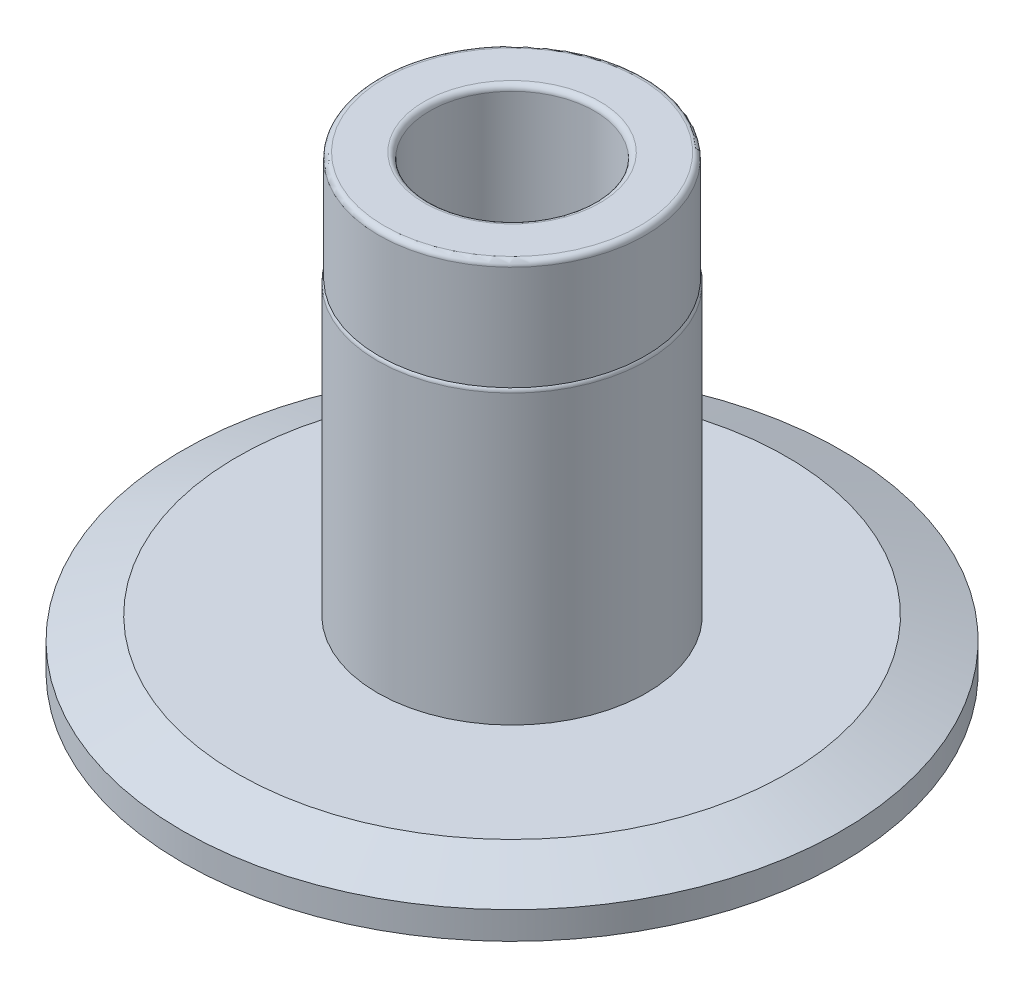
ISO-10303-21;
HEADER;
FILE_DESCRIPTION(('STEP AP214'),'2;1');
FILE_NAME('part.step','',(''),(''),'','','');
FILE_SCHEMA(('AUTOMOTIVE_DESIGN { 1 0 10303 214 1 1 1 1 }'));
ENDSEC;
DATA;
#1=APPLICATION_CONTEXT('core data for automotive mechanical design processes');
#2=APPLICATION_PROTOCOL_DEFINITION('international standard','automotive_design',2000,#1);
#3=PRODUCT_CONTEXT('',#1,'mechanical');
#4=PRODUCT('Part','Part','',(#3));
#5=PRODUCT_RELATED_PRODUCT_CATEGORY('part','',(#4));
#6=PRODUCT_DEFINITION_FORMATION('','',#4);
#7=PRODUCT_DEFINITION_CONTEXT('part definition',#1,'design');
#8=PRODUCT_DEFINITION('design','',#6,#7);
#9=PRODUCT_DEFINITION_SHAPE('','',#8);
#10=(LENGTH_UNIT() NAMED_UNIT(*) SI_UNIT(.MILLI.,.METRE.));
#11=(NAMED_UNIT(*) PLANE_ANGLE_UNIT() SI_UNIT($,.RADIAN.));
#12=(NAMED_UNIT(*) SI_UNIT($,.STERADIAN.) SOLID_ANGLE_UNIT());
#13=UNCERTAINTY_MEASURE_WITH_UNIT(LENGTH_MEASURE(1.E-05),#10,'distance_accuracy_value','');
#14=(GEOMETRIC_REPRESENTATION_CONTEXT(3) GLOBAL_UNCERTAINTY_ASSIGNED_CONTEXT((#13)) GLOBAL_UNIT_ASSIGNED_CONTEXT((#10,
#11,#12)) REPRESENTATION_CONTEXT('',''));
#15=CARTESIAN_POINT('',(0.,0.,0.));
#16=DIRECTION('',(0.,0.,1.));
#17=DIRECTION('',(1.,0.,0.));
#18=AXIS2_PLACEMENT_3D('',#15,#16,#17);
#19=CARTESIAN_POINT('',(0.,-0.4,0.));
#20=DIRECTION('',(0.,1.,0.));
#21=DIRECTION('',(0.,0.,1.));
#22=AXIS2_PLACEMENT_3D('',#19,#20,#21);
#23=CYLINDRICAL_SURFACE('',#22,2.45);
#24=CARTESIAN_POINT('',(0.,6.13385621722338,0.));
#25=DIRECTION('',(0.,1.,0.));
#26=DIRECTION('',(0.,0.,1.));
#27=AXIS2_PLACEMENT_3D('',#24,#25,#26);
#28=CIRCLE('',#27,2.45);
#29=CARTESIAN_POINT('',(0.,6.13385621722338,2.45));
#30=VERTEX_POINT('',#29);
#31=EDGE_CURVE('E54',#30,#30,#28,.F.);
#32=ORIENTED_EDGE('',*,*,#31,.T.);
#33=EDGE_LOOP('',(#32));
#34=FACE_BOUND('',#33,.T.);
#35=CARTESIAN_POINT('',(0.,0.9,0.));
#36=DIRECTION('',(0.,1.,0.));
#37=DIRECTION('',(0.,0.,1.));
#38=AXIS2_PLACEMENT_3D('',#35,#36,#37);
#39=CIRCLE('',#38,2.45);
#40=CARTESIAN_POINT('',(0.,0.9,2.45));
#41=VERTEX_POINT('',#40);
#42=EDGE_CURVE('E91',#41,#41,#39,.T.);
#43=ORIENTED_EDGE('',*,*,#42,.T.);
#44=EDGE_LOOP('',(#43));
#45=FACE_BOUND('',#44,.T.);
#46=ADVANCED_FACE('F39',(#34,#45),#23,.T.);
#47=CARTESIAN_POINT('',(0.,8.2,0.));
#48=DIRECTION('',(0.,1.,0.));
#49=DIRECTION('',(0.,0.,1.));
#50=AXIS2_PLACEMENT_3D('',#47,#48,#49);
#51=PLANE('',#50);
#52=CARTESIAN_POINT('',(0.,8.2,0.));
#53=DIRECTION('',(0.,1.,0.));
#54=DIRECTION('',(0.,0.,1.));
#55=AXIS2_PLACEMENT_3D('',#52,#53,#54);
#56=CIRCLE('',#55,2.325);
#57=CARTESIAN_POINT('',(0.,8.2,2.325));
#58=VERTEX_POINT('',#57);
#59=EDGE_CURVE('E83',#58,#58,#56,.T.);
#60=ORIENTED_EDGE('',*,*,#59,.T.);
#61=EDGE_LOOP('',(#60));
#62=FACE_BOUND('',#61,.T.);
#63=CARTESIAN_POINT('',(0.,8.2,0.));
#64=DIRECTION('',(0.,1.,0.));
#65=DIRECTION('',(0.,0.,1.));
#66=AXIS2_PLACEMENT_3D('',#63,#64,#65);
#67=CIRCLE('',#66,1.6);
#68=CARTESIAN_POINT('',(0.,8.2,1.6));
#69=VERTEX_POINT('',#68);
#70=EDGE_CURVE('E87',#69,#69,#67,.F.);
#71=ORIENTED_EDGE('',*,*,#70,.T.);
#72=EDGE_LOOP('',(#71));
#73=FACE_BOUND('',#72,.T.);
#74=ADVANCED_FACE('F118',(#62,#73),#51,.T.);
#75=CARTESIAN_POINT('',(0.,0.9,0.));
#76=DIRECTION('',(0.,1.,0.));
#77=DIRECTION('',(0.,0.,1.));
#78=AXIS2_PLACEMENT_3D('',#75,#76,#77);
#79=PLANE('',#78);
#80=CARTESIAN_POINT('',(0.,0.9,0.));
#81=DIRECTION('',(0.,1.,0.));
#82=DIRECTION('',(0.,0.,1.));
#83=AXIS2_PLACEMENT_3D('',#80,#81,#82);
#84=CIRCLE('',#83,4.99999999999999);
#85=CARTESIAN_POINT('',(0.,0.9,4.99999999999999));
#86=VERTEX_POINT('',#85);
#87=EDGE_CURVE('E47',#86,#86,#84,.T.);
#88=ORIENTED_EDGE('',*,*,#87,.T.);
#89=EDGE_LOOP('',(#88));
#90=FACE_BOUND('',#89,.T.);
#91=ORIENTED_EDGE('',*,*,#42,.F.);
#92=EDGE_LOOP('',(#91));
#93=FACE_BOUND('',#92,.T.);
#94=ADVANCED_FACE('F123',(#90,#93),#79,.T.);
#95=CARTESIAN_POINT('',(0.,0.,0.));
#96=DIRECTION('',(0.,1.,0.));
#97=DIRECTION('',(0.,0.,1.));
#98=AXIS2_PLACEMENT_3D('',#95,#96,#97);
#99=PLANE('',#98);
#100=CARTESIAN_POINT('',(0.,0.,0.));
#101=DIRECTION('',(0.,1.,0.));
#102=DIRECTION('',(0.,0.,1.));
#103=AXIS2_PLACEMENT_3D('',#100,#101,#102);
#104=CIRCLE('',#103,2.45);
#105=CARTESIAN_POINT('',(0.,0.,2.45));
#106=VERTEX_POINT('',#105);
#107=EDGE_CURVE('E92',#106,#106,#104,.T.);
#108=ORIENTED_EDGE('',*,*,#107,.T.);
#109=EDGE_LOOP('',(#108));
#110=FACE_BOUND('',#109,.T.);
#111=CARTESIAN_POINT('',(0.,0.,0.));
#112=DIRECTION('',(0.,1.,0.));
#113=DIRECTION('',(0.,0.,1.));
#114=AXIS2_PLACEMENT_3D('',#111,#112,#113);
#115=CIRCLE('',#114,6.);
#116=CARTESIAN_POINT('',(0.,0.,6.));
#117=VERTEX_POINT('',#116);
#118=EDGE_CURVE('E96',#117,#117,#115,.T.);
#119=ORIENTED_EDGE('',*,*,#118,.F.);
#120=EDGE_LOOP('',(#119));
#121=FACE_BOUND('',#120,.T.);
#122=ADVANCED_FACE('F125',(#110,#121),#99,.F.);
#123=CARTESIAN_POINT('',(0.,0.9,0.));
#124=DIRECTION('',(0.,-1.,0.));
#125=DIRECTION('',(0.,0.,-1.));
#126=AXIS2_PLACEMENT_3D('',#123,#124,#125);
#127=CYLINDRICAL_SURFACE('',#126,6.);
#128=CARTESIAN_POINT('',(0.,0.499999999999999,0.));
#129=DIRECTION('',(0.,1.,0.));
#130=DIRECTION('',(0.,0.,1.));
#131=AXIS2_PLACEMENT_3D('',#128,#129,#130);
#132=CIRCLE('',#131,6.);
#133=CARTESIAN_POINT('',(0.,0.499999999999999,6.));
#134=VERTEX_POINT('',#133);
#135=EDGE_CURVE('E11',#134,#134,#132,.F.);
#136=ORIENTED_EDGE('',*,*,#135,.T.);
#137=EDGE_LOOP('',(#136));
#138=FACE_BOUND('',#137,.T.);
#139=ORIENTED_EDGE('',*,*,#118,.T.);
#140=EDGE_LOOP('',(#139));
#141=FACE_BOUND('',#140,.T.);
#142=ADVANCED_FACE('F131',(#138,#141),#127,.T.);
#143=CARTESIAN_POINT('',(0.,-0.3,0.));
#144=DIRECTION('',(0.,1.,0.));
#145=DIRECTION('',(0.,0.,1.));
#146=AXIS2_PLACEMENT_3D('',#143,#144,#145);
#147=CIRCLE('',#146,2.45);
#148=CARTESIAN_POINT('',(0.,-0.3,2.45));
#149=VERTEX_POINT('',#148);
#150=EDGE_CURVE('E61',#149,#149,#147,.T.);
#151=ORIENTED_EDGE('',*,*,#150,.T.);
#152=EDGE_LOOP('',(#151));
#153=FACE_BOUND('',#152,.T.);
#154=ORIENTED_EDGE('',*,*,#107,.F.);
#155=EDGE_LOOP('',(#154));
#156=FACE_BOUND('',#155,.T.);
#157=ADVANCED_FACE('F120',(#153,#156),#23,.T.);
#158=CARTESIAN_POINT('',(0.,-0.4,0.));
#159=DIRECTION('',(0.,1.,0.));
#160=DIRECTION('',(0.,0.,1.));
#161=AXIS2_PLACEMENT_3D('',#158,#159,#160);
#162=PLANE('',#161);
#163=CARTESIAN_POINT('',(0.,-0.4,0.));
#164=DIRECTION('',(0.,1.,0.));
#165=DIRECTION('',(0.,0.,1.));
#166=AXIS2_PLACEMENT_3D('',#163,#164,#165);
#167=CIRCLE('',#166,1.6);
#168=CARTESIAN_POINT('',(0.,-0.4,1.6));
#169=VERTEX_POINT('',#168);
#170=EDGE_CURVE('E67',#169,#169,#167,.T.);
#171=ORIENTED_EDGE('',*,*,#170,.T.);
#172=EDGE_LOOP('',(#171));
#173=FACE_BOUND('',#172,.T.);
#174=CARTESIAN_POINT('',(0.,-0.4,0.));
#175=DIRECTION('',(0.,1.,0.));
#176=DIRECTION('',(0.,0.,1.));
#177=AXIS2_PLACEMENT_3D('',#174,#175,#176);
#178=CIRCLE('',#177,2.35);
#179=CARTESIAN_POINT('',(0.,-0.4,2.35));
#180=VERTEX_POINT('',#179);
#181=EDGE_CURVE('E71',#180,#180,#178,.F.);
#182=ORIENTED_EDGE('',*,*,#181,.T.);
#183=EDGE_LOOP('',(#182));
#184=FACE_BOUND('',#183,.T.);
#185=ADVANCED_FACE('F163',(#173,#184),#162,.F.);
#186=CARTESIAN_POINT('',(0.,0.9,0.));
#187=DIRECTION('',(0.,-1.,0.));
#188=DIRECTION('',(0.,0.,-1.));
#189=AXIS2_PLACEMENT_3D('',#186,#187,#188);
#190=CYLINDRICAL_SURFACE('',#189,1.5);
#191=CARTESIAN_POINT('',(0.,8.1,0.));
#192=DIRECTION('',(0.,1.,0.));
#193=DIRECTION('',(0.,0.,1.));
#194=AXIS2_PLACEMENT_3D('',#191,#192,#193);
#195=CIRCLE('',#194,1.5);
#196=CARTESIAN_POINT('',(0.,8.1,1.5));
#197=VERTEX_POINT('',#196);
#198=EDGE_CURVE('E74',#197,#197,#195,.T.);
#199=ORIENTED_EDGE('',*,*,#198,.T.);
#200=EDGE_LOOP('',(#199));
#201=FACE_BOUND('',#200,.T.);
#202=CARTESIAN_POINT('',(0.,-0.3,0.));
#203=DIRECTION('',(0.,1.,0.));
#204=DIRECTION('',(0.,0.,1.));
#205=AXIS2_PLACEMENT_3D('',#202,#203,#204);
#206=CIRCLE('',#205,1.5);
#207=CARTESIAN_POINT('',(0.,-0.3,1.5));
#208=VERTEX_POINT('',#207);
#209=EDGE_CURVE('E77',#208,#208,#206,.F.);
#210=ORIENTED_EDGE('',*,*,#209,.T.);
#211=EDGE_LOOP('',(#210));
#212=FACE_BOUND('',#211,.T.);
#213=ADVANCED_FACE('F137',(#201,#212),#190,.F.);
#214=CARTESIAN_POINT('',(0.,6.2,0.));
#215=DIRECTION('',(0.,1.,0.));
#216=DIRECTION('',(0.,0.,1.));
#217=AXIS2_PLACEMENT_3D('',#214,#215,#216);
#218=CYLINDRICAL_SURFACE('',#217,2.425);
#219=CARTESIAN_POINT('',(0.,8.1,0.));
#220=DIRECTION('',(0.,1.,0.));
#221=DIRECTION('',(0.,0.,1.));
#222=AXIS2_PLACEMENT_3D('',#219,#220,#221);
#223=CIRCLE('',#222,2.425);
#224=CARTESIAN_POINT('',(0.,8.1,2.425));
#225=VERTEX_POINT('',#224);
#226=EDGE_CURVE('E80',#225,#225,#223,.F.);
#227=ORIENTED_EDGE('',*,*,#226,.T.);
#228=EDGE_LOOP('',(#227));
#229=FACE_BOUND('',#228,.T.);
#230=CARTESIAN_POINT('',(0.,6.2,0.));
#231=DIRECTION('',(0.,1.,0.));
#232=DIRECTION('',(0.,0.,1.));
#233=AXIS2_PLACEMENT_3D('',#230,#231,#232);
#234=CIRCLE('',#233,2.425);
#235=CARTESIAN_POINT('',(0.,6.2,2.425));
#236=VERTEX_POINT('',#235);
#237=EDGE_CURVE('E97',#236,#236,#234,.T.);
#238=ORIENTED_EDGE('',*,*,#237,.T.);
#239=EDGE_LOOP('',(#238));
#240=FACE_BOUND('',#239,.T.);
#241=ADVANCED_FACE('F108',(#229,#240),#218,.T.);
#242=CARTESIAN_POINT('',(0.,8.1,0.));
#243=DIRECTION('',(0.,1.,0.));
#244=DIRECTION('',(0.,0.,1.));
#245=AXIS2_PLACEMENT_3D('',#242,#243,#244);
#246=TOROIDAL_SURFACE('',#245,2.325,0.1);
#247=ORIENTED_EDGE('',*,*,#226,.F.);
#248=EDGE_LOOP('',(#247));
#249=FACE_BOUND('',#248,.T.);
#250=ORIENTED_EDGE('',*,*,#59,.F.);
#251=EDGE_LOOP('',(#250));
#252=FACE_BOUND('',#251,.T.);
#253=ADVANCED_FACE('F141',(#249,#252),#246,.T.);
#254=CARTESIAN_POINT('',(0.,8.1,0.));
#255=DIRECTION('',(0.,1.,0.));
#256=DIRECTION('',(0.,0.,1.));
#257=AXIS2_PLACEMENT_3D('',#254,#255,#256);
#258=TOROIDAL_SURFACE('',#257,1.6,0.1);
#259=ORIENTED_EDGE('',*,*,#70,.F.);
#260=EDGE_LOOP('',(#259));
#261=FACE_BOUND('',#260,.T.);
#262=ORIENTED_EDGE('',*,*,#198,.F.);
#263=EDGE_LOOP('',(#262));
#264=FACE_BOUND('',#263,.T.);
#265=ADVANCED_FACE('F144',(#261,#264),#258,.T.);
#266=CARTESIAN_POINT('',(0.,-0.3,0.));
#267=DIRECTION('',(0.,1.,0.));
#268=DIRECTION('',(0.,0.,1.));
#269=AXIS2_PLACEMENT_3D('',#266,#267,#268);
#270=TOROIDAL_SURFACE('',#269,1.6,0.1);
#271=ORIENTED_EDGE('',*,*,#209,.F.);
#272=EDGE_LOOP('',(#271));
#273=FACE_BOUND('',#272,.T.);
#274=ORIENTED_EDGE('',*,*,#170,.F.);
#275=EDGE_LOOP('',(#274));
#276=FACE_BOUND('',#275,.T.);
#277=ADVANCED_FACE('F148',(#273,#276),#270,.T.);
#278=CARTESIAN_POINT('',(0.,-0.3,0.));
#279=DIRECTION('',(0.,1.,0.));
#280=DIRECTION('',(0.,0.,1.));
#281=AXIS2_PLACEMENT_3D('',#278,#279,#280);
#282=TOROIDAL_SURFACE('',#281,2.35,0.1);
#283=ORIENTED_EDGE('',*,*,#181,.F.);
#284=EDGE_LOOP('',(#283));
#285=FACE_BOUND('',#284,.T.);
#286=ORIENTED_EDGE('',*,*,#150,.F.);
#287=EDGE_LOOP('',(#286));
#288=FACE_BOUND('',#287,.T.);
#289=ADVANCED_FACE('F113',(#285,#288),#282,.T.);
#290=CARTESIAN_POINT('',(0.,6.13385621722338,0.));
#291=DIRECTION('',(0.,1.,0.));
#292=DIRECTION('',(0.,0.,1.));
#293=AXIS2_PLACEMENT_3D('',#290,#291,#292);
#294=TOROIDAL_SURFACE('',#293,2.35,0.1);
#295=ORIENTED_EDGE('',*,*,#237,.F.);
#296=EDGE_LOOP('',(#295));
#297=FACE_BOUND('',#296,.T.);
#298=ORIENTED_EDGE('',*,*,#31,.F.);
#299=EDGE_LOOP('',(#298));
#300=FACE_BOUND('',#299,.T.);
#301=ADVANCED_FACE('F110',(#297,#300),#294,.T.);
#302=CARTESIAN_POINT('',(0.,0.9,0.));
#303=DIRECTION('',(0.,-1.,0.));
#304=DIRECTION('',(0.,0.,-1.));
#305=AXIS2_PLACEMENT_3D('',#302,#303,#304);
#306=CONICAL_SURFACE('',#305,4.99999999999999,1.19028994968253);
#307=ORIENTED_EDGE('',*,*,#135,.F.);
#308=EDGE_LOOP('',(#307));
#309=FACE_BOUND('',#308,.T.);
#310=ORIENTED_EDGE('',*,*,#87,.F.);
#311=EDGE_LOOP('',(#310));
#312=FACE_BOUND('',#311,.T.);
#313=ADVANCED_FACE('F41',(#309,#312),#306,.T.);
#314=CLOSED_SHELL('',(#46,#74,#94,#122,#142,#157,#185,#213,#241,#253,#265,#277,#289,#301,#313));
#315=MANIFOLD_SOLID_BREP('B2',#314);
#316=ADVANCED_BREP_SHAPE_REPRESENTATION('',(#18,#315),#14);
#317=SHAPE_DEFINITION_REPRESENTATION(#9,#316);
ENDSEC;
END-ISO-10303-21;
